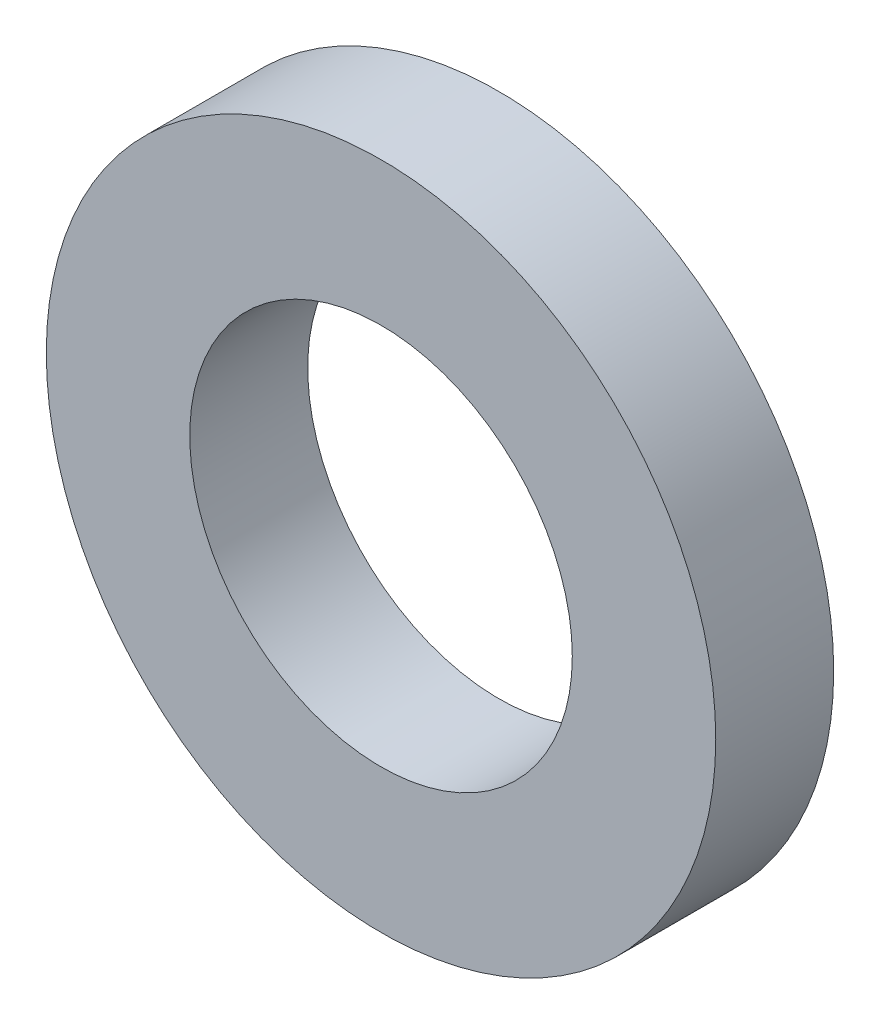
ISO-10303-21;
HEADER;
FILE_DESCRIPTION(('STEP AP214'),'2;1');
FILE_NAME('part.step','',(''),(''),'','','');
FILE_SCHEMA(('AUTOMOTIVE_DESIGN { 1 0 10303 214 1 1 1 1 }'));
ENDSEC;
DATA;
#1=APPLICATION_CONTEXT('core data for automotive mechanical design processes');
#2=APPLICATION_PROTOCOL_DEFINITION('international standard','automotive_design',2000,#1);
#3=PRODUCT_CONTEXT('',#1,'mechanical');
#4=PRODUCT('Part','Part','',(#3));
#5=PRODUCT_RELATED_PRODUCT_CATEGORY('part','',(#4));
#6=PRODUCT_DEFINITION_FORMATION('','',#4);
#7=PRODUCT_DEFINITION_CONTEXT('part definition',#1,'design');
#8=PRODUCT_DEFINITION('design','',#6,#7);
#9=PRODUCT_DEFINITION_SHAPE('','',#8);
#10=(LENGTH_UNIT() NAMED_UNIT(*) SI_UNIT(.MILLI.,.METRE.));
#11=(NAMED_UNIT(*) PLANE_ANGLE_UNIT() SI_UNIT($,.RADIAN.));
#12=(NAMED_UNIT(*) SI_UNIT($,.STERADIAN.) SOLID_ANGLE_UNIT());
#13=UNCERTAINTY_MEASURE_WITH_UNIT(LENGTH_MEASURE(1.E-05),#10,'distance_accuracy_value','');
#14=(GEOMETRIC_REPRESENTATION_CONTEXT(3) GLOBAL_UNCERTAINTY_ASSIGNED_CONTEXT((#13)) GLOBAL_UNIT_ASSIGNED_CONTEXT((#10,
#11,#12)) REPRESENTATION_CONTEXT('',''));
#15=CARTESIAN_POINT('',(0.,0.,0.));
#16=DIRECTION('',(0.,0.,1.));
#17=DIRECTION('',(1.,0.,0.));
#18=AXIS2_PLACEMENT_3D('',#15,#16,#17);
#19=CARTESIAN_POINT('',(0.,8.25,1.85));
#20=DIRECTION('',(0.,0.,1.));
#21=DIRECTION('',(1.,0.,0.));
#22=AXIS2_PLACEMENT_3D('',#19,#20,#21);
#23=PLANE('',#22);
#24=CARTESIAN_POINT('',(0.,0.,1.85));
#25=DIRECTION('',(0.,0.,1.));
#26=DIRECTION('',(1.,0.,0.));
#27=AXIS2_PLACEMENT_3D('',#24,#25,#26);
#28=CIRCLE('',#27,6.);
#29=CARTESIAN_POINT('',(6.,0.,1.85));
#30=VERTEX_POINT('',#29);
#31=EDGE_CURVE('E17',#30,#30,#28,.F.);
#32=ORIENTED_EDGE('',*,*,#31,.T.);
#33=EDGE_LOOP('',(#32));
#34=FACE_BOUND('',#33,.T.);
#35=CARTESIAN_POINT('',(0.,0.,1.85));
#36=DIRECTION('',(0.,0.,1.));
#37=DIRECTION('',(1.,0.,0.));
#38=AXIS2_PLACEMENT_3D('',#35,#36,#37);
#39=CIRCLE('',#38,10.5);
#40=CARTESIAN_POINT('',(10.5,0.,1.85));
#41=VERTEX_POINT('',#40);
#42=EDGE_CURVE('E26',#41,#41,#39,.F.);
#43=ORIENTED_EDGE('',*,*,#42,.F.);
#44=EDGE_LOOP('',(#43));
#45=FACE_BOUND('',#44,.T.);
#46=ADVANCED_FACE('F14',(#34,#45),#23,.T.);
#47=CARTESIAN_POINT('',(0.,0.,0.));
#48=DIRECTION('',(0.,0.,1.));
#49=DIRECTION('',(1.,0.,0.));
#50=AXIS2_PLACEMENT_3D('',#47,#48,#49);
#51=CYLINDRICAL_SURFACE('',#50,6.);
#52=ORIENTED_EDGE('',*,*,#31,.F.);
#53=EDGE_LOOP('',(#52));
#54=FACE_BOUND('',#53,.T.);
#55=CARTESIAN_POINT('',(0.,0.,-1.85));
#56=DIRECTION('',(0.,0.,1.));
#57=DIRECTION('',(1.,0.,0.));
#58=AXIS2_PLACEMENT_3D('',#55,#56,#57);
#59=CIRCLE('',#58,6.);
#60=CARTESIAN_POINT('',(6.,0.,-1.85));
#61=VERTEX_POINT('',#60);
#62=EDGE_CURVE('E21',#61,#61,#59,.T.);
#63=ORIENTED_EDGE('',*,*,#62,.F.);
#64=EDGE_LOOP('',(#63));
#65=FACE_BOUND('',#64,.T.);
#66=ADVANCED_FACE('F36',(#54,#65),#51,.F.);
#67=CARTESIAN_POINT('',(0.,0.,0.));
#68=DIRECTION('',(0.,0.,1.));
#69=DIRECTION('',(1.,0.,0.));
#70=AXIS2_PLACEMENT_3D('',#67,#68,#69);
#71=CYLINDRICAL_SURFACE('',#70,10.5);
#72=CARTESIAN_POINT('',(0.,0.,-1.85));
#73=DIRECTION('',(0.,0.,1.));
#74=DIRECTION('',(1.,0.,0.));
#75=AXIS2_PLACEMENT_3D('',#72,#73,#74);
#76=CIRCLE('',#75,10.5);
#77=CARTESIAN_POINT('',(10.5,0.,-1.85));
#78=VERTEX_POINT('',#77);
#79=EDGE_CURVE('E10',#78,#78,#76,.F.);
#80=ORIENTED_EDGE('',*,*,#79,.F.);
#81=EDGE_LOOP('',(#80));
#82=FACE_BOUND('',#81,.T.);
#83=ORIENTED_EDGE('',*,*,#42,.T.);
#84=EDGE_LOOP('',(#83));
#85=FACE_BOUND('',#84,.T.);
#86=ADVANCED_FACE('F39',(#82,#85),#71,.T.);
#87=CARTESIAN_POINT('',(0.,8.25,-1.85));
#88=DIRECTION('',(0.,0.,-1.));
#89=DIRECTION('',(-1.,0.,0.));
#90=AXIS2_PLACEMENT_3D('',#87,#88,#89);
#91=PLANE('',#90);
#92=ORIENTED_EDGE('',*,*,#79,.T.);
#93=EDGE_LOOP('',(#92));
#94=FACE_BOUND('',#93,.T.);
#95=ORIENTED_EDGE('',*,*,#62,.T.);
#96=EDGE_LOOP('',(#95));
#97=FACE_BOUND('',#96,.T.);
#98=ADVANCED_FACE('F42',(#94,#97),#91,.T.);
#99=CLOSED_SHELL('',(#46,#66,#86,#98));
#100=MANIFOLD_SOLID_BREP('B1',#99);
#101=ADVANCED_BREP_SHAPE_REPRESENTATION('',(#18,#100),#14);
#102=SHAPE_DEFINITION_REPRESENTATION(#9,#101);
ENDSEC;
END-ISO-10303-21;
